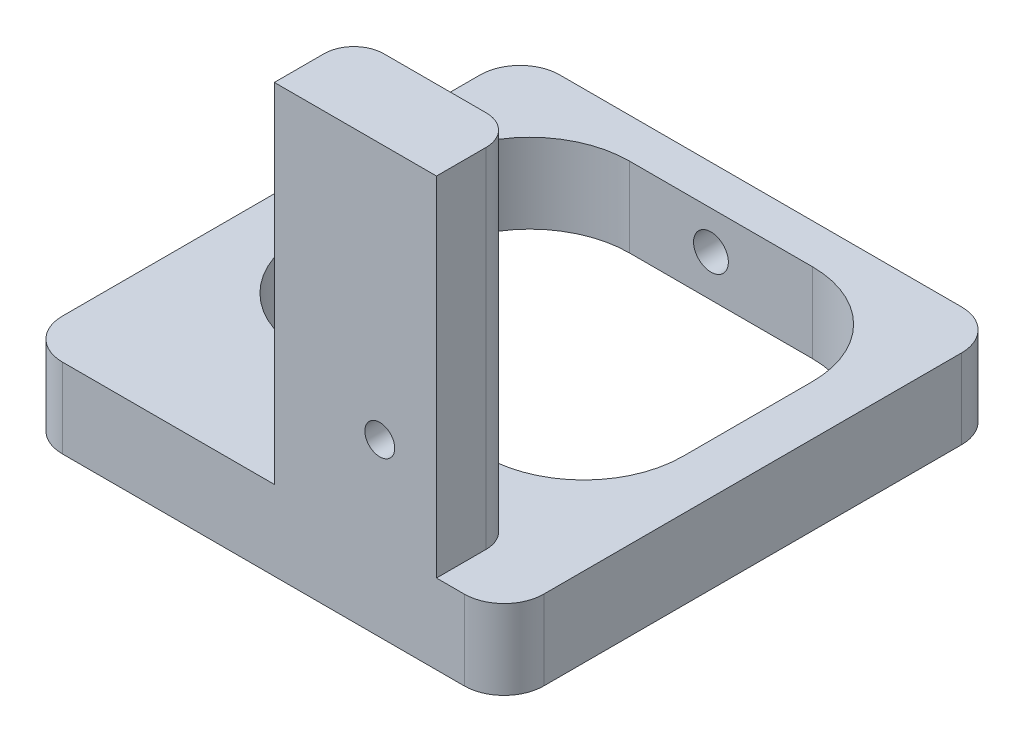
ISO-10303-21;
HEADER;
FILE_DESCRIPTION(('STEP AP214'),'2;1');
FILE_NAME('part.step','',(''),(''),'','','');
FILE_SCHEMA(('AUTOMOTIVE_DESIGN { 1 0 10303 214 1 1 1 1 }'));
ENDSEC;
DATA;
#1=APPLICATION_CONTEXT('core data for automotive mechanical design processes');
#2=APPLICATION_PROTOCOL_DEFINITION('international standard','automotive_design',2000,#1);
#3=PRODUCT_CONTEXT('',#1,'mechanical');
#4=PRODUCT('Part','Part','',(#3));
#5=PRODUCT_RELATED_PRODUCT_CATEGORY('part','',(#4));
#6=PRODUCT_DEFINITION_FORMATION('','',#4);
#7=PRODUCT_DEFINITION_CONTEXT('part definition',#1,'design');
#8=PRODUCT_DEFINITION('design','',#6,#7);
#9=PRODUCT_DEFINITION_SHAPE('','',#8);
#10=(LENGTH_UNIT() NAMED_UNIT(*) SI_UNIT(.MILLI.,.METRE.));
#11=(NAMED_UNIT(*) PLANE_ANGLE_UNIT() SI_UNIT($,.RADIAN.));
#12=(NAMED_UNIT(*) SI_UNIT($,.STERADIAN.) SOLID_ANGLE_UNIT());
#13=UNCERTAINTY_MEASURE_WITH_UNIT(LENGTH_MEASURE(1.E-05),#10,'distance_accuracy_value','');
#14=(GEOMETRIC_REPRESENTATION_CONTEXT(3) GLOBAL_UNCERTAINTY_ASSIGNED_CONTEXT((#13)) GLOBAL_UNIT_ASSIGNED_CONTEXT((#10,
#11,#12)) REPRESENTATION_CONTEXT('',''));
#15=CARTESIAN_POINT('',(0.,0.,0.));
#16=DIRECTION('',(0.,0.,1.));
#17=DIRECTION('',(1.,0.,0.));
#18=AXIS2_PLACEMENT_3D('',#15,#16,#17);
#19=CARTESIAN_POINT('',(325.190686012613,343.382010011375,8.));
#20=DIRECTION('',(0.,0.,-1.));
#21=DIRECTION('',(-1.,0.,0.));
#22=AXIS2_PLACEMENT_3D('',#19,#20,#21);
#23=CYLINDRICAL_SURFACE('',#22,1.50000000000002);
#24=CARTESIAN_POINT('',(325.190686012613,343.382010011375,8.));
#25=DIRECTION('',(0.,0.,1.));
#26=DIRECTION('',(1.,0.,0.));
#27=AXIS2_PLACEMENT_3D('',#24,#25,#26);
#28=CIRCLE('',#27,1.50000000000002);
#29=CARTESIAN_POINT('',(326.690686012613,343.382010011375,8.));
#30=VERTEX_POINT('',#29);
#31=EDGE_CURVE('E281',#30,#30,#28,.T.);
#32=ORIENTED_EDGE('',*,*,#31,.T.);
#33=EDGE_LOOP('',(#32));
#34=FACE_BOUND('',#33,.T.);
#35=CARTESIAN_POINT('',(325.190686012613,343.382010011375,3.2));
#36=DIRECTION('',(0.,0.,-1.));
#37=DIRECTION('',(-1.,0.,0.));
#38=AXIS2_PLACEMENT_3D('',#35,#36,#37);
#39=CIRCLE('',#38,1.50000000000002);
#40=CARTESIAN_POINT('',(323.690686012613,343.382010011375,3.2));
#41=VERTEX_POINT('',#40);
#42=EDGE_CURVE('E317',#41,#41,#39,.T.);
#43=ORIENTED_EDGE('',*,*,#42,.T.);
#44=EDGE_LOOP('',(#43));
#45=FACE_BOUND('',#44,.T.);
#46=ADVANCED_FACE('F37',(#34,#45),#23,.F.);
#47=CARTESIAN_POINT('',(0.,0.,8.));
#48=DIRECTION('',(0.,0.,1.));
#49=DIRECTION('',(1.,0.,0.));
#50=AXIS2_PLACEMENT_3D('',#47,#48,#49);
#51=PLANE('',#50);
#52=DIRECTION('',(-1.,0.,0.));
#53=VECTOR('',#52,1.);
#54=CARTESIAN_POINT('',(289.281750966355,326.182010011375,8.));
#55=LINE('',#54,#53);
#56=CARTESIAN_POINT('',(333.681750966355,326.182010011375,8.00000000000001));
#57=VERTEX_POINT('',#56);
#58=CARTESIAN_POINT('',(293.281750966355,326.182010011375,8.));
#59=VERTEX_POINT('',#58);
#60=EDGE_CURVE('E271',#57,#59,#55,.T.);
#61=ORIENTED_EDGE('',*,*,#60,.F.);
#62=DIRECTION('',(0.,1.,0.));
#63=VECTOR('',#62,1.);
#64=CARTESIAN_POINT('',(333.681750966355,334.182010011375,8.));
#65=LINE('',#64,#63);
#66=CARTESIAN_POINT('',(333.681750966355,334.182010011375,8.00000000000001));
#67=VERTEX_POINT('',#66);
#68=EDGE_CURVE('E354',#57,#67,#65,.T.);
#69=ORIENTED_EDGE('',*,*,#68,.T.);
#70=DIRECTION('',(-1.,0.,0.));
#71=VECTOR('',#70,1.);
#72=CARTESIAN_POINT('',(289.281750966355,334.182010011375,8.));
#73=LINE('',#72,#71);
#74=CARTESIAN_POINT('',(330.890686012613,334.182010011375,8.));
#75=VERTEX_POINT('',#74);
#76=EDGE_CURVE('E285',#67,#75,#73,.T.);
#77=ORIENTED_EDGE('',*,*,#76,.T.);
#78=DIRECTION('',(0.,1.,0.));
#79=VECTOR('',#78,1.);
#80=CARTESIAN_POINT('',(330.890686012613,369.182010011375,8.));
#81=LINE('',#80,#79);
#82=CARTESIAN_POINT('',(330.890686012613,369.182010011375,8.));
#83=VERTEX_POINT('',#82);
#84=EDGE_CURVE('E297',#75,#83,#81,.T.);
#85=ORIENTED_EDGE('',*,*,#84,.T.);
#86=DIRECTION('',(-1.,0.,0.));
#87=VECTOR('',#86,1.);
#88=CARTESIAN_POINT('',(314.590686012613,369.182010011375,8.));
#89=LINE('',#88,#87);
#90=CARTESIAN_POINT('',(314.590686012613,369.182010011375,8.));
#91=VERTEX_POINT('',#90);
#92=EDGE_CURVE('E300',#83,#91,#89,.T.);
#93=ORIENTED_EDGE('',*,*,#92,.T.);
#94=DIRECTION('',(0.,-1.,0.));
#95=VECTOR('',#94,1.);
#96=CARTESIAN_POINT('',(314.590686012613,369.182010011375,8.));
#97=LINE('',#96,#95);
#98=CARTESIAN_POINT('',(314.590686012613,334.182010011375,8.));
#99=VERTEX_POINT('',#98);
#100=EDGE_CURVE('E295',#91,#99,#97,.T.);
#101=ORIENTED_EDGE('',*,*,#100,.T.);
#102=CARTESIAN_POINT('',(293.281750966355,334.182010011375,8.));
#103=VERTEX_POINT('',#102);
#104=EDGE_CURVE('E284',#99,#103,#73,.T.);
#105=ORIENTED_EDGE('',*,*,#104,.T.);
#106=DIRECTION('',(0.,1.,0.));
#107=VECTOR('',#106,1.);
#108=CARTESIAN_POINT('',(293.281750966355,326.182010011375,8.));
#109=LINE('',#108,#107);
#110=EDGE_CURVE('E352',#103,#59,#109,.F.);
#111=ORIENTED_EDGE('',*,*,#110,.T.);
#112=EDGE_LOOP('',(#61,#69,#77,#85,#93,#101,#105,#111));
#113=FACE_BOUND('',#112,.T.);
#114=ORIENTED_EDGE('',*,*,#31,.F.);
#115=EDGE_LOOP('',(#114));
#116=FACE_BOUND('',#115,.T.);
#117=ADVANCED_FACE('F443',(#113,#116),#51,.T.);
#118=CARTESIAN_POINT('',(0.,0.,0.));
#119=DIRECTION('',(0.,0.,1.));
#120=DIRECTION('',(1.,0.,0.));
#121=AXIS2_PLACEMENT_3D('',#118,#119,#120);
#122=PLANE('',#121);
#123=DIRECTION('',(1.,0.,0.));
#124=VECTOR('',#123,1.);
#125=CARTESIAN_POINT('',(314.590686012613,334.182010011375,0.));
#126=LINE('',#125,#124);
#127=CARTESIAN_POINT('',(317.590686012613,334.182010011375,0.));
#128=VERTEX_POINT('',#127);
#129=CARTESIAN_POINT('',(327.890686012613,334.182010011375,0.));
#130=VERTEX_POINT('',#129);
#131=EDGE_CURVE('E294',#128,#130,#126,.T.);
#132=ORIENTED_EDGE('',*,*,#131,.F.);
#133=DIRECTION('',(0.,-1.,0.));
#134=VECTOR('',#133,1.);
#135=CARTESIAN_POINT('',(317.590686012613,0.,0.));
#136=LINE('',#135,#134);
#137=CARTESIAN_POINT('',(317.590686012613,369.182010011375,0.));
#138=VERTEX_POINT('',#137);
#139=EDGE_CURVE('E364',#128,#138,#136,.F.);
#140=ORIENTED_EDGE('',*,*,#139,.T.);
#141=DIRECTION('',(-1.,0.,0.));
#142=VECTOR('',#141,1.);
#143=CARTESIAN_POINT('',(314.590686012613,369.182010011375,0.));
#144=LINE('',#143,#142);
#145=CARTESIAN_POINT('',(327.890686012613,369.182010011375,0.));
#146=VERTEX_POINT('',#145);
#147=EDGE_CURVE('E298',#146,#138,#144,.T.);
#148=ORIENTED_EDGE('',*,*,#147,.F.);
#149=DIRECTION('',(0.,1.,0.));
#150=VECTOR('',#149,1.);
#151=CARTESIAN_POINT('',(327.890686012613,0.,0.));
#152=LINE('',#151,#150);
#153=CARTESIAN_POINT('',(327.890686012613,344.689679694437,0.));
#154=VERTEX_POINT('',#153);
#155=EDGE_CURVE('E362',#146,#154,#152,.F.);
#156=ORIENTED_EDGE('',*,*,#155,.T.);
#157=CARTESIAN_POINT('',(325.190686012613,343.382010011375,0.));
#158=DIRECTION('',(0.,0.,-1.));
#159=DIRECTION('',(-1.,0.,0.));
#160=AXIS2_PLACEMENT_3D('',#157,#158,#159);
#161=CIRCLE('',#160,2.99999999999999);
#162=CARTESIAN_POINT('',(327.890686012613,342.074340328312,0.));
#163=VERTEX_POINT('',#162);
#164=EDGE_CURVE('E504',#163,#154,#161,.T.);
#165=ORIENTED_EDGE('',*,*,#164,.F.);
#166=DIRECTION('',(0.,1.,0.));
#167=VECTOR('',#166,1.);
#168=CARTESIAN_POINT('',(327.890686012613,0.,0.));
#169=LINE('',#168,#167);
#170=EDGE_CURVE('E360',#163,#130,#169,.F.);
#171=ORIENTED_EDGE('',*,*,#170,.T.);
#172=EDGE_LOOP('',(#132,#140,#148,#156,#165,#171));
#173=FACE_BOUND('',#172,.T.);
#174=ADVANCED_FACE('F447',(#173),#122,.F.);
#175=CARTESIAN_POINT('',(314.590686012613,369.182010011375,8.));
#176=DIRECTION('',(1.,0.,0.));
#177=DIRECTION('',(0.,0.,-1.));
#178=AXIS2_PLACEMENT_3D('',#175,#176,#177);
#179=PLANE('',#178);
#180=DIRECTION('',(0.,0.,-1.));
#181=VECTOR('',#180,1.);
#182=CARTESIAN_POINT('',(314.590686012613,369.182010011375,8.));
#183=LINE('',#182,#181);
#184=CARTESIAN_POINT('',(314.590686012613,369.182010011375,3.));
#185=VERTEX_POINT('',#184);
#186=EDGE_CURVE('E302',#91,#185,#183,.T.);
#187=ORIENTED_EDGE('',*,*,#186,.T.);
#188=DIRECTION('',(0.,-1.,0.));
#189=VECTOR('',#188,1.);
#190=CARTESIAN_POINT('',(314.590686012613,369.182010011375,3.));
#191=LINE('',#190,#189);
#192=CARTESIAN_POINT('',(314.590686012613,334.182010011375,3.));
#193=VERTEX_POINT('',#192);
#194=EDGE_CURVE('E357',#185,#193,#191,.T.);
#195=ORIENTED_EDGE('',*,*,#194,.T.);
#196=DIRECTION('',(0.,0.,-1.));
#197=VECTOR('',#196,1.);
#198=CARTESIAN_POINT('',(314.590686012613,334.182010011375,8.));
#199=LINE('',#198,#197);
#200=EDGE_CURVE('E313',#99,#193,#199,.T.);
#201=ORIENTED_EDGE('',*,*,#200,.F.);
#202=ORIENTED_EDGE('',*,*,#100,.F.);
#203=EDGE_LOOP('',(#187,#195,#201,#202));
#204=FACE_BOUND('',#203,.T.);
#205=ADVANCED_FACE('F451',(#204),#179,.F.);
#206=CARTESIAN_POINT('',(330.890686012613,369.182010011375,8.));
#207=DIRECTION('',(-1.,0.,0.));
#208=DIRECTION('',(0.,0.,1.));
#209=AXIS2_PLACEMENT_3D('',#206,#207,#208);
#210=PLANE('',#209);
#211=DIRECTION('',(0.,0.,-1.));
#212=VECTOR('',#211,1.);
#213=CARTESIAN_POINT('',(330.890686012613,334.182010011375,8.));
#214=LINE('',#213,#212);
#215=CARTESIAN_POINT('',(330.890686012613,334.182010011375,3.));
#216=VERTEX_POINT('',#215);
#217=EDGE_CURVE('E311',#75,#216,#214,.T.);
#218=ORIENTED_EDGE('',*,*,#217,.T.);
#219=DIRECTION('',(0.,1.,0.));
#220=VECTOR('',#219,1.);
#221=CARTESIAN_POINT('',(330.890686012613,369.182010011375,3.));
#222=LINE('',#221,#220);
#223=CARTESIAN_POINT('',(330.890686012613,369.182010011375,3.));
#224=VERTEX_POINT('',#223);
#225=EDGE_CURVE('E369',#216,#224,#222,.T.);
#226=ORIENTED_EDGE('',*,*,#225,.T.);
#227=DIRECTION('',(0.,0.,-1.));
#228=VECTOR('',#227,1.);
#229=CARTESIAN_POINT('',(330.890686012613,369.182010011375,8.));
#230=LINE('',#229,#228);
#231=EDGE_CURVE('E308',#83,#224,#230,.T.);
#232=ORIENTED_EDGE('',*,*,#231,.F.);
#233=ORIENTED_EDGE('',*,*,#84,.F.);
#234=EDGE_LOOP('',(#218,#226,#232,#233));
#235=FACE_BOUND('',#234,.T.);
#236=ADVANCED_FACE('F455',(#235),#210,.F.);
#237=CARTESIAN_POINT('',(314.590686012613,369.182010011375,8.));
#238=DIRECTION('',(0.,-1.,0.));
#239=DIRECTION('',(0.,0.,-1.));
#240=AXIS2_PLACEMENT_3D('',#237,#238,#239);
#241=PLANE('',#240);
#242=ORIENTED_EDGE('',*,*,#147,.T.);
#243=CARTESIAN_POINT('',(317.590686012613,369.182010011375,3.));
#244=DIRECTION('',(0.,-1.,0.));
#245=DIRECTION('',(0.,0.,-1.));
#246=AXIS2_PLACEMENT_3D('',#243,#244,#245);
#247=CIRCLE('',#246,3.);
#248=EDGE_CURVE('E367',#138,#185,#247,.F.);
#249=ORIENTED_EDGE('',*,*,#248,.T.);
#250=ORIENTED_EDGE('',*,*,#186,.F.);
#251=ORIENTED_EDGE('',*,*,#92,.F.);
#252=ORIENTED_EDGE('',*,*,#231,.T.);
#253=CARTESIAN_POINT('',(327.890686012613,369.182010011375,3.));
#254=DIRECTION('',(0.,-1.,0.));
#255=DIRECTION('',(0.,0.,-1.));
#256=AXIS2_PLACEMENT_3D('',#253,#254,#255);
#257=CIRCLE('',#256,3.);
#258=EDGE_CURVE('E59',#224,#146,#257,.F.);
#259=ORIENTED_EDGE('',*,*,#258,.T.);
#260=EDGE_LOOP('',(#242,#249,#250,#251,#252,#259));
#261=FACE_BOUND('',#260,.T.);
#262=ADVANCED_FACE('F429',(#261),#241,.F.);
#263=CARTESIAN_POINT('',(0.,334.182010011375,0.));
#264=DIRECTION('',(0.,1.,0.));
#265=DIRECTION('',(0.,0.,1.));
#266=AXIS2_PLACEMENT_3D('',#263,#264,#265);
#267=PLANE('',#266);
#268=DIRECTION('',(0.,0.,-1.));
#269=VECTOR('',#268,1.);
#270=CARTESIAN_POINT('',(294.281750966355,334.182010011375,-28.));
#271=LINE('',#270,#269);
#272=CARTESIAN_POINT('',(294.281750966355,334.182010011375,-15.));
#273=VERTEX_POINT('',#272);
#274=CARTESIAN_POINT('',(294.281750966355,334.182010011375,-28.));
#275=VERTEX_POINT('',#274);
#276=EDGE_CURVE('E206',#273,#275,#271,.T.);
#277=ORIENTED_EDGE('',*,*,#276,.T.);
#278=CARTESIAN_POINT('',(304.281750966355,334.182010011375,-28.));
#279=DIRECTION('',(0.,-1.,0.));
#280=DIRECTION('',(0.,0.,1.));
#281=AXIS2_PLACEMENT_3D('',#278,#279,#280);
#282=CIRCLE('',#281,10.);
#283=CARTESIAN_POINT('',(304.281750966355,334.182010011375,-38.));
#284=VERTEX_POINT('',#283);
#285=EDGE_CURVE('E235',#275,#284,#282,.T.);
#286=ORIENTED_EDGE('',*,*,#285,.T.);
#287=DIRECTION('',(1.,0.,0.));
#288=VECTOR('',#287,1.);
#289=CARTESIAN_POINT('',(322.681750966355,334.182010011375,-38.));
#290=LINE('',#289,#288);
#291=CARTESIAN_POINT('',(322.681750966355,334.182010011375,-38.));
#292=VERTEX_POINT('',#291);
#293=EDGE_CURVE('E212',#284,#292,#290,.T.);
#294=ORIENTED_EDGE('',*,*,#293,.T.);
#295=CARTESIAN_POINT('',(322.681750966355,334.182010011375,-28.));
#296=DIRECTION('',(0.,-1.,0.));
#297=DIRECTION('',(0.,0.,1.));
#298=AXIS2_PLACEMENT_3D('',#295,#296,#297);
#299=CIRCLE('',#298,10.);
#300=CARTESIAN_POINT('',(332.681750966355,334.182010011375,-28.));
#301=VERTEX_POINT('',#300);
#302=EDGE_CURVE('E239',#292,#301,#299,.T.);
#303=ORIENTED_EDGE('',*,*,#302,.T.);
#304=DIRECTION('',(0.,0.,1.));
#305=VECTOR('',#304,1.);
#306=CARTESIAN_POINT('',(332.681750966355,334.182010011375,-28.));
#307=LINE('',#306,#305);
#308=CARTESIAN_POINT('',(332.681750966355,334.182010011375,-15.));
#309=VERTEX_POINT('',#308);
#310=EDGE_CURVE('E242',#301,#309,#307,.T.);
#311=ORIENTED_EDGE('',*,*,#310,.T.);
#312=CARTESIAN_POINT('',(322.681750966355,334.182010011375,-15.));
#313=DIRECTION('',(0.,-1.,0.));
#314=DIRECTION('',(0.,0.,-1.));
#315=AXIS2_PLACEMENT_3D('',#312,#313,#314);
#316=CIRCLE('',#315,10.);
#317=CARTESIAN_POINT('',(322.681750966355,334.182010011375,-4.99999999999999));
#318=VERTEX_POINT('',#317);
#319=EDGE_CURVE('E245',#309,#318,#316,.T.);
#320=ORIENTED_EDGE('',*,*,#319,.T.);
#321=DIRECTION('',(-1.,0.,0.));
#322=VECTOR('',#321,1.);
#323=CARTESIAN_POINT('',(322.681750966355,334.182010011375,-5.));
#324=LINE('',#323,#322);
#325=CARTESIAN_POINT('',(304.281750966355,334.182010011375,-5.));
#326=VERTEX_POINT('',#325);
#327=EDGE_CURVE('E248',#318,#326,#324,.T.);
#328=ORIENTED_EDGE('',*,*,#327,.T.);
#329=CARTESIAN_POINT('',(304.281750966355,334.182010011375,-15.));
#330=DIRECTION('',(0.,-1.,0.));
#331=DIRECTION('',(0.,0.,1.));
#332=AXIS2_PLACEMENT_3D('',#329,#330,#331);
#333=CIRCLE('',#332,10.);
#334=EDGE_CURVE('E251',#326,#273,#333,.T.);
#335=ORIENTED_EDGE('',*,*,#334,.T.);
#336=EDGE_LOOP('',(#277,#286,#294,#303,#311,#320,#328,#335));
#337=FACE_BOUND('',#336,.T.);
#338=DIRECTION('',(0.,0.,1.));
#339=VECTOR('',#338,1.);
#340=CARTESIAN_POINT('',(337.681750966355,334.182010011375,-42.));
#341=LINE('',#340,#339);
#342=CARTESIAN_POINT('',(337.681750966355,334.182010011375,-38.));
#343=VERTEX_POINT('',#342);
#344=CARTESIAN_POINT('',(337.681750966355,334.182010011375,4.));
#345=VERTEX_POINT('',#344);
#346=EDGE_CURVE('E213',#343,#345,#341,.T.);
#347=ORIENTED_EDGE('',*,*,#346,.F.);
#348=CARTESIAN_POINT('',(333.681750966355,334.182010011375,-38.));
#349=DIRECTION('',(0.,1.,0.));
#350=DIRECTION('',(0.,0.,1.));
#351=AXIS2_PLACEMENT_3D('',#348,#349,#350);
#352=CIRCLE('',#351,4.);
#353=CARTESIAN_POINT('',(333.681750966355,334.182010011375,-42.));
#354=VERTEX_POINT('',#353);
#355=EDGE_CURVE('E332',#343,#354,#352,.T.);
#356=ORIENTED_EDGE('',*,*,#355,.T.);
#357=DIRECTION('',(1.,0.,0.));
#358=VECTOR('',#357,1.);
#359=CARTESIAN_POINT('',(289.281750966355,334.182010011375,-42.));
#360=LINE('',#359,#358);
#361=CARTESIAN_POINT('',(293.281750966355,334.182010011375,-42.));
#362=VERTEX_POINT('',#361);
#363=EDGE_CURVE('E272',#362,#354,#360,.T.);
#364=ORIENTED_EDGE('',*,*,#363,.F.);
#365=CARTESIAN_POINT('',(293.281750966355,334.182010011375,-38.));
#366=DIRECTION('',(0.,1.,0.));
#367=DIRECTION('',(0.,0.,1.));
#368=AXIS2_PLACEMENT_3D('',#365,#366,#367);
#369=CIRCLE('',#368,4.);
#370=CARTESIAN_POINT('',(289.281750966355,334.182010011375,-38.));
#371=VERTEX_POINT('',#370);
#372=EDGE_CURVE('E330',#362,#371,#369,.T.);
#373=ORIENTED_EDGE('',*,*,#372,.T.);
#374=DIRECTION('',(0.,0.,-1.));
#375=VECTOR('',#374,1.);
#376=CARTESIAN_POINT('',(289.281750966355,334.182010011375,-42.));
#377=LINE('',#376,#375);
#378=CARTESIAN_POINT('',(289.281750966355,334.182010011375,4.));
#379=VERTEX_POINT('',#378);
#380=EDGE_CURVE('E287',#379,#371,#377,.T.);
#381=ORIENTED_EDGE('',*,*,#380,.F.);
#382=CARTESIAN_POINT('',(293.281750966355,334.182010011375,4.));
#383=DIRECTION('',(0.,1.,0.));
#384=DIRECTION('',(0.,0.,1.));
#385=AXIS2_PLACEMENT_3D('',#382,#383,#384);
#386=CIRCLE('',#385,4.);
#387=EDGE_CURVE('E326',#379,#103,#386,.T.);
#388=ORIENTED_EDGE('',*,*,#387,.T.);
#389=ORIENTED_EDGE('',*,*,#104,.F.);
#390=ORIENTED_EDGE('',*,*,#200,.T.);
#391=CARTESIAN_POINT('',(317.590686012613,334.182010011375,3.));
#392=DIRECTION('',(0.,1.,0.));
#393=DIRECTION('',(0.,0.,1.));
#394=AXIS2_PLACEMENT_3D('',#391,#392,#393);
#395=CIRCLE('',#394,3.);
#396=EDGE_CURVE('E46',#193,#128,#395,.F.);
#397=ORIENTED_EDGE('',*,*,#396,.T.);
#398=ORIENTED_EDGE('',*,*,#131,.T.);
#399=CARTESIAN_POINT('',(327.890686012613,334.182010011375,3.));
#400=DIRECTION('',(0.,1.,0.));
#401=DIRECTION('',(0.,0.,1.));
#402=AXIS2_PLACEMENT_3D('',#399,#400,#401);
#403=CIRCLE('',#402,3.);
#404=EDGE_CURVE('E11',#130,#216,#403,.F.);
#405=ORIENTED_EDGE('',*,*,#404,.T.);
#406=ORIENTED_EDGE('',*,*,#217,.F.);
#407=ORIENTED_EDGE('',*,*,#76,.F.);
#408=CARTESIAN_POINT('',(333.681750966355,334.182010011375,4.));
#409=DIRECTION('',(0.,1.,0.));
#410=DIRECTION('',(0.,0.,1.));
#411=AXIS2_PLACEMENT_3D('',#408,#409,#410);
#412=CIRCLE('',#411,4.);
#413=EDGE_CURVE('E328',#67,#345,#412,.T.);
#414=ORIENTED_EDGE('',*,*,#413,.T.);
#415=EDGE_LOOP('',(#347,#356,#364,#373,#381,#388,#389,#390,#397,#398,#405,#406,#407,#414));
#416=FACE_BOUND('',#415,.T.);
#417=ADVANCED_FACE('F425',(#337,#416),#267,.T.);
#418=CARTESIAN_POINT('',(0.,326.182010011375,0.));
#419=DIRECTION('',(0.,1.,0.));
#420=DIRECTION('',(0.,0.,1.));
#421=AXIS2_PLACEMENT_3D('',#418,#419,#420);
#422=PLANE('',#421);
#423=DIRECTION('',(1.,0.,0.));
#424=VECTOR('',#423,1.);
#425=CARTESIAN_POINT('',(289.281750966355,326.182010011375,-42.));
#426=LINE('',#425,#424);
#427=CARTESIAN_POINT('',(293.281750966355,326.182010011375,-42.));
#428=VERTEX_POINT('',#427);
#429=CARTESIAN_POINT('',(333.681750966355,326.182010011375,-42.));
#430=VERTEX_POINT('',#429);
#431=EDGE_CURVE('E278',#428,#430,#426,.T.);
#432=ORIENTED_EDGE('',*,*,#431,.T.);
#433=CARTESIAN_POINT('',(333.681750966355,326.182010011375,-38.));
#434=DIRECTION('',(0.,1.,0.));
#435=DIRECTION('',(0.,0.,1.));
#436=AXIS2_PLACEMENT_3D('',#433,#434,#435);
#437=CIRCLE('',#436,4.);
#438=CARTESIAN_POINT('',(337.681750966355,326.182010011375,-38.));
#439=VERTEX_POINT('',#438);
#440=EDGE_CURVE('E345',#430,#439,#437,.F.);
#441=ORIENTED_EDGE('',*,*,#440,.T.);
#442=DIRECTION('',(0.,0.,1.));
#443=VECTOR('',#442,1.);
#444=CARTESIAN_POINT('',(337.681750966355,326.182010011375,-42.));
#445=LINE('',#444,#443);
#446=CARTESIAN_POINT('',(337.681750966355,326.182010011375,4.));
#447=VERTEX_POINT('',#446);
#448=EDGE_CURVE('E268',#439,#447,#445,.T.);
#449=ORIENTED_EDGE('',*,*,#448,.T.);
#450=CARTESIAN_POINT('',(333.681750966355,326.182010011375,4.));
#451=DIRECTION('',(0.,1.,0.));
#452=DIRECTION('',(0.,0.,1.));
#453=AXIS2_PLACEMENT_3D('',#450,#451,#452);
#454=CIRCLE('',#453,4.);
#455=EDGE_CURVE('E341',#447,#57,#454,.F.);
#456=ORIENTED_EDGE('',*,*,#455,.T.);
#457=ORIENTED_EDGE('',*,*,#60,.T.);
#458=CARTESIAN_POINT('',(293.281750966355,326.182010011375,4.));
#459=DIRECTION('',(0.,1.,0.));
#460=DIRECTION('',(0.,0.,1.));
#461=AXIS2_PLACEMENT_3D('',#458,#459,#460);
#462=CIRCLE('',#461,4.);
#463=CARTESIAN_POINT('',(289.281750966355,326.182010011375,4.));
#464=VERTEX_POINT('',#463);
#465=EDGE_CURVE('E339',#59,#464,#462,.F.);
#466=ORIENTED_EDGE('',*,*,#465,.T.);
#467=DIRECTION('',(0.,0.,-1.));
#468=VECTOR('',#467,1.);
#469=CARTESIAN_POINT('',(289.281750966355,326.182010011375,-42.));
#470=LINE('',#469,#468);
#471=CARTESIAN_POINT('',(289.281750966355,326.182010011375,-38.));
#472=VERTEX_POINT('',#471);
#473=EDGE_CURVE('E275',#464,#472,#470,.T.);
#474=ORIENTED_EDGE('',*,*,#473,.T.);
#475=CARTESIAN_POINT('',(293.281750966355,326.182010011375,-38.));
#476=DIRECTION('',(0.,1.,0.));
#477=DIRECTION('',(0.,0.,1.));
#478=AXIS2_PLACEMENT_3D('',#475,#476,#477);
#479=CIRCLE('',#478,4.);
#480=EDGE_CURVE('E343',#472,#428,#479,.F.);
#481=ORIENTED_EDGE('',*,*,#480,.T.);
#482=EDGE_LOOP('',(#432,#441,#449,#456,#457,#466,#474,#481));
#483=FACE_BOUND('',#482,.T.);
#484=CARTESIAN_POINT('',(304.281750966355,326.182010011375,-28.));
#485=DIRECTION('',(0.,-1.,0.));
#486=DIRECTION('',(0.,0.,1.));
#487=AXIS2_PLACEMENT_3D('',#484,#485,#486);
#488=CIRCLE('',#487,10.);
#489=CARTESIAN_POINT('',(294.281750966355,326.182010011375,-28.));
#490=VERTEX_POINT('',#489);
#491=CARTESIAN_POINT('',(304.281750966355,326.182010011375,-38.));
#492=VERTEX_POINT('',#491);
#493=EDGE_CURVE('E195',#490,#492,#488,.T.);
#494=ORIENTED_EDGE('',*,*,#493,.F.);
#495=DIRECTION('',(0.,0.,-1.));
#496=VECTOR('',#495,1.);
#497=CARTESIAN_POINT('',(294.281750966355,326.182010011375,-28.));
#498=LINE('',#497,#496);
#499=CARTESIAN_POINT('',(294.281750966355,326.182010011375,-15.));
#500=VERTEX_POINT('',#499);
#501=EDGE_CURVE('E233',#500,#490,#498,.T.);
#502=ORIENTED_EDGE('',*,*,#501,.F.);
#503=CARTESIAN_POINT('',(304.281750966355,326.182010011375,-15.));
#504=DIRECTION('',(0.,-1.,0.));
#505=DIRECTION('',(0.,0.,1.));
#506=AXIS2_PLACEMENT_3D('',#503,#504,#505);
#507=CIRCLE('',#506,10.);
#508=CARTESIAN_POINT('',(304.281750966355,326.182010011375,-5.));
#509=VERTEX_POINT('',#508);
#510=EDGE_CURVE('E230',#509,#500,#507,.T.);
#511=ORIENTED_EDGE('',*,*,#510,.F.);
#512=DIRECTION('',(-1.,0.,0.));
#513=VECTOR('',#512,1.);
#514=CARTESIAN_POINT('',(322.681750966355,326.182010011375,-5.));
#515=LINE('',#514,#513);
#516=CARTESIAN_POINT('',(322.681750966355,326.182010011375,-4.99999999999999));
#517=VERTEX_POINT('',#516);
#518=EDGE_CURVE('E228',#517,#509,#515,.T.);
#519=ORIENTED_EDGE('',*,*,#518,.F.);
#520=CARTESIAN_POINT('',(322.681750966355,326.182010011375,-15.));
#521=DIRECTION('',(0.,-1.,0.));
#522=DIRECTION('',(0.,0.,-1.));
#523=AXIS2_PLACEMENT_3D('',#520,#521,#522);
#524=CIRCLE('',#523,10.);
#525=CARTESIAN_POINT('',(332.681750966355,326.182010011375,-15.));
#526=VERTEX_POINT('',#525);
#527=EDGE_CURVE('E226',#526,#517,#524,.T.);
#528=ORIENTED_EDGE('',*,*,#527,.F.);
#529=DIRECTION('',(0.,0.,1.));
#530=VECTOR('',#529,1.);
#531=CARTESIAN_POINT('',(332.681750966355,326.182010011375,-28.));
#532=LINE('',#531,#530);
#533=CARTESIAN_POINT('',(332.681750966355,326.182010011375,-28.));
#534=VERTEX_POINT('',#533);
#535=EDGE_CURVE('E221',#534,#526,#532,.T.);
#536=ORIENTED_EDGE('',*,*,#535,.F.);
#537=CARTESIAN_POINT('',(322.681750966355,326.182010011375,-28.));
#538=DIRECTION('',(0.,-1.,0.));
#539=DIRECTION('',(0.,0.,1.));
#540=AXIS2_PLACEMENT_3D('',#537,#538,#539);
#541=CIRCLE('',#540,10.);
#542=CARTESIAN_POINT('',(322.681750966355,326.182010011375,-38.));
#543=VERTEX_POINT('',#542);
#544=EDGE_CURVE('E219',#543,#534,#541,.T.);
#545=ORIENTED_EDGE('',*,*,#544,.F.);
#546=DIRECTION('',(1.,0.,0.));
#547=VECTOR('',#546,1.);
#548=CARTESIAN_POINT('',(322.681750966355,326.182010011375,-38.));
#549=LINE('',#548,#547);
#550=EDGE_CURVE('E205',#492,#543,#549,.T.);
#551=ORIENTED_EDGE('',*,*,#550,.F.);
#552=EDGE_LOOP('',(#494,#502,#511,#519,#528,#536,#545,#551));
#553=FACE_BOUND('',#552,.T.);
#554=ADVANCED_FACE('F217',(#483,#553),#422,.F.);
#555=CARTESIAN_POINT('',(337.681750966355,326.182010011375,-42.));
#556=DIRECTION('',(-1.,0.,0.));
#557=DIRECTION('',(0.,0.,1.));
#558=AXIS2_PLACEMENT_3D('',#555,#556,#557);
#559=PLANE('',#558);
#560=ORIENTED_EDGE('',*,*,#448,.F.);
#561=DIRECTION('',(0.,1.,0.));
#562=VECTOR('',#561,1.);
#563=CARTESIAN_POINT('',(337.681750966355,326.182010011375,-38.));
#564=LINE('',#563,#562);
#565=EDGE_CURVE('E323',#439,#343,#564,.T.);
#566=ORIENTED_EDGE('',*,*,#565,.T.);
#567=ORIENTED_EDGE('',*,*,#346,.T.);
#568=DIRECTION('',(0.,1.,0.));
#569=VECTOR('',#568,1.);
#570=CARTESIAN_POINT('',(337.681750966355,326.182010011375,4.));
#571=LINE('',#570,#569);
#572=EDGE_CURVE('E316',#345,#447,#571,.F.);
#573=ORIENTED_EDGE('',*,*,#572,.T.);
#574=EDGE_LOOP('',(#560,#566,#567,#573));
#575=FACE_BOUND('',#574,.T.);
#576=ADVANCED_FACE('F424',(#575),#559,.F.);
#577=CARTESIAN_POINT('',(289.281750966355,326.182010011375,-42.));
#578=DIRECTION('',(1.,0.,0.));
#579=DIRECTION('',(0.,0.,-1.));
#580=AXIS2_PLACEMENT_3D('',#577,#578,#579);
#581=PLANE('',#580);
#582=CARTESIAN_POINT('',(289.281750966355,330.202094394195,-21.));
#583=DIRECTION('',(-1.,0.,0.));
#584=DIRECTION('',(0.,0.,1.));
#585=AXIS2_PLACEMENT_3D('',#582,#583,#584);
#586=CIRCLE('',#585,1.75);
#587=CARTESIAN_POINT('',(289.281750966355,330.202094394195,-19.25));
#588=VERTEX_POINT('',#587);
#589=EDGE_CURVE('E320',#588,#588,#586,.T.);
#590=ORIENTED_EDGE('',*,*,#589,.F.);
#591=EDGE_LOOP('',(#590));
#592=FACE_BOUND('',#591,.T.);
#593=ORIENTED_EDGE('',*,*,#380,.T.);
#594=DIRECTION('',(0.,1.,0.));
#595=VECTOR('',#594,1.);
#596=CARTESIAN_POINT('',(289.281750966355,326.182010011375,-38.));
#597=LINE('',#596,#595);
#598=EDGE_CURVE('E350',#371,#472,#597,.F.);
#599=ORIENTED_EDGE('',*,*,#598,.T.);
#600=ORIENTED_EDGE('',*,*,#473,.F.);
#601=DIRECTION('',(0.,1.,0.));
#602=VECTOR('',#601,1.);
#603=CARTESIAN_POINT('',(289.281750966355,334.182010011375,4.));
#604=LINE('',#603,#602);
#605=EDGE_CURVE('E347',#464,#379,#604,.T.);
#606=ORIENTED_EDGE('',*,*,#605,.T.);
#607=EDGE_LOOP('',(#593,#599,#600,#606));
#608=FACE_BOUND('',#607,.T.);
#609=ADVANCED_FACE('F433',(#592,#608),#581,.F.);
#610=CARTESIAN_POINT('',(289.281750966355,326.182010011375,-42.));
#611=DIRECTION('',(0.,0.,1.));
#612=DIRECTION('',(1.,0.,0.));
#613=AXIS2_PLACEMENT_3D('',#610,#611,#612);
#614=PLANE('',#613);
#615=CARTESIAN_POINT('',(312.481750966355,330.362434357887,-42.));
#616=DIRECTION('',(0.,0.,-1.));
#617=DIRECTION('',(-1.,0.,0.));
#618=AXIS2_PLACEMENT_3D('',#615,#616,#617);
#619=CIRCLE('',#618,1.74999999999998);
#620=CARTESIAN_POINT('',(310.731750966355,330.362434357887,-42.));
#621=VERTEX_POINT('',#620);
#622=EDGE_CURVE('E535',#621,#621,#619,.T.);
#623=ORIENTED_EDGE('',*,*,#622,.F.);
#624=EDGE_LOOP('',(#623));
#625=FACE_BOUND('',#624,.T.);
#626=ORIENTED_EDGE('',*,*,#363,.T.);
#627=DIRECTION('',(0.,1.,0.));
#628=VECTOR('',#627,1.);
#629=CARTESIAN_POINT('',(333.681750966355,326.182010011375,-42.));
#630=LINE('',#629,#628);
#631=EDGE_CURVE('E337',#354,#430,#630,.F.);
#632=ORIENTED_EDGE('',*,*,#631,.T.);
#633=ORIENTED_EDGE('',*,*,#431,.F.);
#634=DIRECTION('',(0.,1.,0.));
#635=VECTOR('',#634,1.);
#636=CARTESIAN_POINT('',(293.281750966355,326.182010011375,-42.));
#637=LINE('',#636,#635);
#638=EDGE_CURVE('E334',#428,#362,#637,.T.);
#639=ORIENTED_EDGE('',*,*,#638,.T.);
#640=EDGE_LOOP('',(#626,#632,#633,#639));
#641=FACE_BOUND('',#640,.T.);
#642=ADVANCED_FACE('F421',(#625,#641),#614,.F.);
#643=CARTESIAN_POINT('',(304.281750966355,326.182010011375,-28.));
#644=DIRECTION('',(0.,1.,0.));
#645=DIRECTION('',(0.,0.,1.));
#646=AXIS2_PLACEMENT_3D('',#643,#644,#645);
#647=CYLINDRICAL_SURFACE('',#646,10.);
#648=ORIENTED_EDGE('',*,*,#285,.F.);
#649=DIRECTION('',(0.,1.,0.));
#650=VECTOR('',#649,1.);
#651=CARTESIAN_POINT('',(294.281750966355,326.182010011375,-28.));
#652=LINE('',#651,#650);
#653=EDGE_CURVE('E201',#490,#275,#652,.T.);
#654=ORIENTED_EDGE('',*,*,#653,.F.);
#655=ORIENTED_EDGE('',*,*,#493,.T.);
#656=DIRECTION('',(0.,1.,0.));
#657=VECTOR('',#656,1.);
#658=CARTESIAN_POINT('',(304.281750966355,326.182010011375,-38.));
#659=LINE('',#658,#657);
#660=EDGE_CURVE('E198',#492,#284,#659,.T.);
#661=ORIENTED_EDGE('',*,*,#660,.T.);
#662=EDGE_LOOP('',(#648,#654,#655,#661));
#663=FACE_BOUND('',#662,.T.);
#664=ADVANCED_FACE('F197',(#663),#647,.F.);
#665=CARTESIAN_POINT('',(322.681750966355,326.182010011375,-38.));
#666=DIRECTION('',(0.,0.,1.));
#667=DIRECTION('',(1.,0.,0.));
#668=AXIS2_PLACEMENT_3D('',#665,#666,#667);
#669=PLANE('',#668);
#670=CARTESIAN_POINT('',(312.481750966355,330.362434357887,-38.));
#671=DIRECTION('',(0.,0.,1.));
#672=DIRECTION('',(1.,0.,0.));
#673=AXIS2_PLACEMENT_3D('',#670,#671,#672);
#674=CIRCLE('',#673,1.74999999999998);
#675=CARTESIAN_POINT('',(314.231750966355,330.362434357887,-38.));
#676=VERTEX_POINT('',#675);
#677=EDGE_CURVE('E237',#676,#676,#674,.F.);
#678=ORIENTED_EDGE('',*,*,#677,.T.);
#679=EDGE_LOOP('',(#678));
#680=FACE_BOUND('',#679,.T.);
#681=ORIENTED_EDGE('',*,*,#293,.F.);
#682=ORIENTED_EDGE('',*,*,#660,.F.);
#683=ORIENTED_EDGE('',*,*,#550,.T.);
#684=DIRECTION('',(0.,1.,0.));
#685=VECTOR('',#684,1.);
#686=CARTESIAN_POINT('',(322.681750966355,326.182010011375,-38.));
#687=LINE('',#686,#685);
#688=EDGE_CURVE('E214',#543,#292,#687,.T.);
#689=ORIENTED_EDGE('',*,*,#688,.T.);
#690=EDGE_LOOP('',(#681,#682,#683,#689));
#691=FACE_BOUND('',#690,.T.);
#692=ADVANCED_FACE('F209',(#680,#691),#669,.T.);
#693=CARTESIAN_POINT('',(322.681750966355,326.182010011375,-28.));
#694=DIRECTION('',(0.,1.,0.));
#695=DIRECTION('',(0.,0.,1.));
#696=AXIS2_PLACEMENT_3D('',#693,#694,#695);
#697=CYLINDRICAL_SURFACE('',#696,10.);
#698=ORIENTED_EDGE('',*,*,#302,.F.);
#699=ORIENTED_EDGE('',*,*,#688,.F.);
#700=ORIENTED_EDGE('',*,*,#544,.T.);
#701=DIRECTION('',(0.,1.,0.));
#702=VECTOR('',#701,1.);
#703=CARTESIAN_POINT('',(332.681750966355,326.182010011375,-28.));
#704=LINE('',#703,#702);
#705=EDGE_CURVE('E265',#534,#301,#704,.T.);
#706=ORIENTED_EDGE('',*,*,#705,.T.);
#707=EDGE_LOOP('',(#698,#699,#700,#706));
#708=FACE_BOUND('',#707,.T.);
#709=ADVANCED_FACE('F411',(#708),#697,.F.);
#710=CARTESIAN_POINT('',(332.681750966355,326.182010011375,-28.));
#711=DIRECTION('',(-1.,0.,0.));
#712=DIRECTION('',(0.,0.,1.));
#713=AXIS2_PLACEMENT_3D('',#710,#711,#712);
#714=PLANE('',#713);
#715=ORIENTED_EDGE('',*,*,#310,.F.);
#716=ORIENTED_EDGE('',*,*,#705,.F.);
#717=ORIENTED_EDGE('',*,*,#535,.T.);
#718=DIRECTION('',(0.,1.,0.));
#719=VECTOR('',#718,1.);
#720=CARTESIAN_POINT('',(332.681750966355,326.182010011375,-15.));
#721=LINE('',#720,#719);
#722=EDGE_CURVE('E263',#526,#309,#721,.T.);
#723=ORIENTED_EDGE('',*,*,#722,.T.);
#724=EDGE_LOOP('',(#715,#716,#717,#723));
#725=FACE_BOUND('',#724,.T.);
#726=ADVANCED_FACE('F407',(#725),#714,.T.);
#727=CARTESIAN_POINT('',(322.681750966355,326.182010011375,-15.));
#728=DIRECTION('',(0.,1.,0.));
#729=DIRECTION('',(0.,0.,1.));
#730=AXIS2_PLACEMENT_3D('',#727,#728,#729);
#731=CYLINDRICAL_SURFACE('',#730,10.);
#732=ORIENTED_EDGE('',*,*,#319,.F.);
#733=ORIENTED_EDGE('',*,*,#722,.F.);
#734=ORIENTED_EDGE('',*,*,#527,.T.);
#735=DIRECTION('',(0.,1.,0.));
#736=VECTOR('',#735,1.);
#737=CARTESIAN_POINT('',(322.681750966355,326.182010011375,-4.99999999999999));
#738=LINE('',#737,#736);
#739=EDGE_CURVE('E261',#517,#318,#738,.T.);
#740=ORIENTED_EDGE('',*,*,#739,.T.);
#741=EDGE_LOOP('',(#732,#733,#734,#740));
#742=FACE_BOUND('',#741,.T.);
#743=ADVANCED_FACE('F403',(#742),#731,.F.);
#744=CARTESIAN_POINT('',(322.681750966355,326.182010011375,-5.));
#745=DIRECTION('',(0.,0.,-1.));
#746=DIRECTION('',(-1.,0.,0.));
#747=AXIS2_PLACEMENT_3D('',#744,#745,#746);
#748=PLANE('',#747);
#749=ORIENTED_EDGE('',*,*,#327,.F.);
#750=ORIENTED_EDGE('',*,*,#739,.F.);
#751=ORIENTED_EDGE('',*,*,#518,.T.);
#752=DIRECTION('',(0.,1.,0.));
#753=VECTOR('',#752,1.);
#754=CARTESIAN_POINT('',(304.281750966355,326.182010011375,-5.));
#755=LINE('',#754,#753);
#756=EDGE_CURVE('E259',#509,#326,#755,.T.);
#757=ORIENTED_EDGE('',*,*,#756,.T.);
#758=EDGE_LOOP('',(#749,#750,#751,#757));
#759=FACE_BOUND('',#758,.T.);
#760=ADVANCED_FACE('F399',(#759),#748,.T.);
#761=CARTESIAN_POINT('',(304.281750966355,326.182010011375,-15.));
#762=DIRECTION('',(0.,1.,0.));
#763=DIRECTION('',(0.,0.,1.));
#764=AXIS2_PLACEMENT_3D('',#761,#762,#763);
#765=CYLINDRICAL_SURFACE('',#764,10.);
#766=ORIENTED_EDGE('',*,*,#334,.F.);
#767=ORIENTED_EDGE('',*,*,#756,.F.);
#768=ORIENTED_EDGE('',*,*,#510,.T.);
#769=DIRECTION('',(0.,1.,0.));
#770=VECTOR('',#769,1.);
#771=CARTESIAN_POINT('',(294.281750966355,326.182010011375,-15.));
#772=LINE('',#771,#770);
#773=EDGE_CURVE('E257',#500,#273,#772,.T.);
#774=ORIENTED_EDGE('',*,*,#773,.T.);
#775=EDGE_LOOP('',(#766,#767,#768,#774));
#776=FACE_BOUND('',#775,.T.);
#777=ADVANCED_FACE('F395',(#776),#765,.F.);
#778=CARTESIAN_POINT('',(294.281750966355,326.182010011375,-28.));
#779=DIRECTION('',(1.,0.,0.));
#780=DIRECTION('',(0.,0.,-1.));
#781=AXIS2_PLACEMENT_3D('',#778,#779,#780);
#782=PLANE('',#781);
#783=CARTESIAN_POINT('',(294.281750966355,330.202094394195,-21.));
#784=DIRECTION('',(1.,0.,0.));
#785=DIRECTION('',(0.,0.,-1.));
#786=AXIS2_PLACEMENT_3D('',#783,#784,#785);
#787=CIRCLE('',#786,1.75);
#788=CARTESIAN_POINT('',(294.281750966355,330.202094394195,-22.75));
#789=VERTEX_POINT('',#788);
#790=EDGE_CURVE('E532',#789,#789,#787,.F.);
#791=ORIENTED_EDGE('',*,*,#790,.T.);
#792=EDGE_LOOP('',(#791));
#793=FACE_BOUND('',#792,.T.);
#794=ORIENTED_EDGE('',*,*,#276,.F.);
#795=ORIENTED_EDGE('',*,*,#773,.F.);
#796=ORIENTED_EDGE('',*,*,#501,.T.);
#797=ORIENTED_EDGE('',*,*,#653,.T.);
#798=EDGE_LOOP('',(#794,#795,#796,#797));
#799=FACE_BOUND('',#798,.T.);
#800=ADVANCED_FACE('F391',(#793,#799),#782,.T.);
#801=CARTESIAN_POINT('',(312.481750966355,330.362434357887,-33.0502525316942));
#802=DIRECTION('',(0.,0.,-1.));
#803=DIRECTION('',(-1.,0.,0.));
#804=AXIS2_PLACEMENT_3D('',#801,#802,#803);
#805=CYLINDRICAL_SURFACE('',#804,1.74999999999998);
#806=ORIENTED_EDGE('',*,*,#622,.T.);
#807=EDGE_LOOP('',(#806));
#808=FACE_BOUND('',#807,.T.);
#809=ORIENTED_EDGE('',*,*,#677,.F.);
#810=EDGE_LOOP('',(#809));
#811=FACE_BOUND('',#810,.T.);
#812=ADVANCED_FACE('F387',(#808,#811),#805,.F.);
#813=CARTESIAN_POINT('',(299.23149843466,330.202094394195,-21.));
#814=DIRECTION('',(-1.,0.,0.));
#815=DIRECTION('',(0.,0.,1.));
#816=AXIS2_PLACEMENT_3D('',#813,#814,#815);
#817=CYLINDRICAL_SURFACE('',#816,1.75);
#818=ORIENTED_EDGE('',*,*,#589,.T.);
#819=EDGE_LOOP('',(#818));
#820=FACE_BOUND('',#819,.T.);
#821=ORIENTED_EDGE('',*,*,#790,.F.);
#822=EDGE_LOOP('',(#821));
#823=FACE_BOUND('',#822,.T.);
#824=ADVANCED_FACE('F383',(#820,#823),#817,.F.);
#825=CARTESIAN_POINT('',(325.190686012613,343.382010011375,3.2));
#826=DIRECTION('',(0.,0.,-1.));
#827=DIRECTION('',(-1.,0.,0.));
#828=AXIS2_PLACEMENT_3D('',#825,#826,#827);
#829=CYLINDRICAL_SURFACE('',#828,2.99999999999999);
#830=CARTESIAN_POINT('',(325.190686012613,343.382010011375,3.2));
#831=DIRECTION('',(0.,0.,-1.));
#832=DIRECTION('',(-1.,0.,0.));
#833=AXIS2_PLACEMENT_3D('',#830,#831,#832);
#834=CIRCLE('',#833,2.99999999999999);
#835=CARTESIAN_POINT('',(322.190686012613,343.382010011375,3.2));
#836=VERTEX_POINT('',#835);
#837=EDGE_CURVE('E321',#836,#836,#834,.T.);
#838=ORIENTED_EDGE('',*,*,#837,.F.);
#839=EDGE_LOOP('',(#838));
#840=FACE_BOUND('',#839,.T.);
#841=ORIENTED_EDGE('',*,*,#164,.T.);
#842=CARTESIAN_POINT('',(327.890686012613,344.689679694437,0.));
#843=CARTESIAN_POINT('',(327.927434488273,344.613823708719,1.91341706228833E-05));
#844=CARTESIAN_POINT('',(327.9609672069,344.536418548977,0.000676129666437285));
#845=CARTESIAN_POINT('',(328.021401758481,344.379073824941,0.0026914618909521));
#846=CARTESIAN_POINT('',(328.048303925732,344.299134388649,0.00404976325092763));
#847=CARTESIAN_POINT('',(328.095264693299,344.137336055616,0.00689241113187162));
#848=CARTESIAN_POINT('',(328.115328248701,344.055478594787,0.00837666541242179));
#849=CARTESIAN_POINT('',(328.148500385421,343.890363853089,0.0110518214564967));
#850=CARTESIAN_POINT('',(328.161609186767,343.80710661659,0.0122427324998732));
#851=CARTESIAN_POINT('',(328.180785989178,343.639704005134,0.0140437638160214));
#852=CARTESIAN_POINT('',(328.186847791519,343.55555791386,0.0146533726755842));
#853=CARTESIAN_POINT('',(328.191865777157,343.387052173629,0.0151554174007304));
#854=CARTESIAN_POINT('',(328.190821916148,343.302692523344,0.0150478487943952));
#855=CARTESIAN_POINT('',(328.181637935319,343.134422827331,0.0141385398881478));
#856=CARTESIAN_POINT('',(328.173502990328,343.050512498623,0.0133373058041763));
#857=CARTESIAN_POINT('',(328.150211809239,342.883710952471,0.0112242737009443));
#858=CARTESIAN_POINT('',(328.135057119169,342.800819514751,0.00991258811366648));
#859=CARTESIAN_POINT('',(328.091211596323,342.607447724694,0.00660038544264029));
#860=CARTESIAN_POINT('',(328.059626671745,342.497604345645,0.00452051942761984));
#861=CARTESIAN_POINT('',(328.003065407649,342.336171375658,0.00204733636253067));
#862=CARTESIAN_POINT('',(327.982686910028,342.282927931377,0.00133080438455943));
#863=CARTESIAN_POINT('',(327.938924732799,342.177671813083,0.000308348786469439));
#864=CARTESIAN_POINT('',(327.915540327443,342.125659439904,2.52453254558793E-06));
#865=CARTESIAN_POINT('',(327.890686012613,342.074340328312,0.));
#866=B_SPLINE_CURVE_WITH_KNOTS('',3,(#842,#843,#844,#845,#846,#847,#848,#849,#850,#851,#852,
#853,#854,#855,#856,#857,#858,#859,#860,#861,#862,#863,#864,#865),.UNSPECIFIED.,.F.,.F.,(4,2,2,
2,2,2,2,2,2,2,2,4),(0.,0.25277856504352,0.505544383034985,0.758126662036892,1.01070094962496,
1.2634972404679,1.51629510760892,1.76890864592519,2.02146657507938,2.36355836214568,
2.53452342471276,2.70552984294005),.UNSPECIFIED.);
#867=EDGE_CURVE('E371',#154,#163,#866,.T.);
#868=ORIENTED_EDGE('',*,*,#867,.T.);
#869=EDGE_LOOP('',(#841,#868));
#870=FACE_BOUND('',#869,.T.);
#871=ADVANCED_FACE('F377',(#840,#870),#829,.F.);
#872=CARTESIAN_POINT('',(325.190686012613,343.382010011375,3.2));
#873=DIRECTION('',(0.,0.,-1.));
#874=DIRECTION('',(-1.,0.,0.));
#875=AXIS2_PLACEMENT_3D('',#872,#873,#874);
#876=PLANE('',#875);
#877=ORIENTED_EDGE('',*,*,#42,.F.);
#878=EDGE_LOOP('',(#877));
#879=FACE_BOUND('',#878,.T.);
#880=ORIENTED_EDGE('',*,*,#837,.T.);
#881=EDGE_LOOP('',(#880));
#882=FACE_BOUND('',#881,.T.);
#883=ADVANCED_FACE('F382',(#879,#882),#876,.T.);
#884=CARTESIAN_POINT('',(333.681750966355,326.182010011375,-38.));
#885=DIRECTION('',(0.,1.,0.));
#886=DIRECTION('',(0.,0.,1.));
#887=AXIS2_PLACEMENT_3D('',#884,#885,#886);
#888=CYLINDRICAL_SURFACE('',#887,4.);
#889=ORIENTED_EDGE('',*,*,#440,.F.);
#890=ORIENTED_EDGE('',*,*,#631,.F.);
#891=ORIENTED_EDGE('',*,*,#355,.F.);
#892=ORIENTED_EDGE('',*,*,#565,.F.);
#893=EDGE_LOOP('',(#889,#890,#891,#892));
#894=FACE_BOUND('',#893,.T.);
#895=ADVANCED_FACE('F463',(#894),#888,.T.);
#896=CARTESIAN_POINT('',(293.281750966355,326.182010011375,-38.));
#897=DIRECTION('',(0.,1.,0.));
#898=DIRECTION('',(0.,0.,1.));
#899=AXIS2_PLACEMENT_3D('',#896,#897,#898);
#900=CYLINDRICAL_SURFACE('',#899,4.);
#901=ORIENTED_EDGE('',*,*,#480,.F.);
#902=ORIENTED_EDGE('',*,*,#598,.F.);
#903=ORIENTED_EDGE('',*,*,#372,.F.);
#904=ORIENTED_EDGE('',*,*,#638,.F.);
#905=EDGE_LOOP('',(#901,#902,#903,#904));
#906=FACE_BOUND('',#905,.T.);
#907=ADVANCED_FACE('F466',(#906),#900,.T.);
#908=CARTESIAN_POINT('',(333.681750966355,0.,4.));
#909=DIRECTION('',(0.,-1.,0.));
#910=DIRECTION('',(0.,0.,-1.));
#911=AXIS2_PLACEMENT_3D('',#908,#909,#910);
#912=CYLINDRICAL_SURFACE('',#911,4.);
#913=ORIENTED_EDGE('',*,*,#455,.F.);
#914=ORIENTED_EDGE('',*,*,#572,.F.);
#915=ORIENTED_EDGE('',*,*,#413,.F.);
#916=ORIENTED_EDGE('',*,*,#68,.F.);
#917=EDGE_LOOP('',(#913,#914,#915,#916));
#918=FACE_BOUND('',#917,.T.);
#919=ADVANCED_FACE('F470',(#918),#912,.T.);
#920=CARTESIAN_POINT('',(293.281750966355,326.182010011375,4.));
#921=DIRECTION('',(0.,-1.,0.));
#922=DIRECTION('',(0.,0.,-1.));
#923=AXIS2_PLACEMENT_3D('',#920,#921,#922);
#924=CYLINDRICAL_SURFACE('',#923,4.);
#925=ORIENTED_EDGE('',*,*,#465,.F.);
#926=ORIENTED_EDGE('',*,*,#110,.F.);
#927=ORIENTED_EDGE('',*,*,#387,.F.);
#928=ORIENTED_EDGE('',*,*,#605,.F.);
#929=EDGE_LOOP('',(#925,#926,#927,#928));
#930=FACE_BOUND('',#929,.T.);
#931=ADVANCED_FACE('F474',(#930),#924,.T.);
#932=CARTESIAN_POINT('',(317.590686012613,369.182010011375,3.));
#933=DIRECTION('',(0.,-1.,0.));
#934=DIRECTION('',(0.,0.,-1.));
#935=AXIS2_PLACEMENT_3D('',#932,#933,#934);
#936=CYLINDRICAL_SURFACE('',#935,3.);
#937=ORIENTED_EDGE('',*,*,#248,.F.);
#938=ORIENTED_EDGE('',*,*,#139,.F.);
#939=ORIENTED_EDGE('',*,*,#396,.F.);
#940=ORIENTED_EDGE('',*,*,#194,.F.);
#941=EDGE_LOOP('',(#937,#938,#939,#940));
#942=FACE_BOUND('',#941,.T.);
#943=ADVANCED_FACE('F477',(#942),#936,.T.);
#944=CARTESIAN_POINT('',(327.890686012613,369.182010011375,3.));
#945=DIRECTION('',(0.,1.,0.));
#946=DIRECTION('',(0.,0.,1.));
#947=AXIS2_PLACEMENT_3D('',#944,#945,#946);
#948=CYLINDRICAL_SURFACE('',#947,3.);
#949=ORIENTED_EDGE('',*,*,#867,.F.);
#950=ORIENTED_EDGE('',*,*,#155,.F.);
#951=ORIENTED_EDGE('',*,*,#258,.F.);
#952=ORIENTED_EDGE('',*,*,#225,.F.);
#953=ORIENTED_EDGE('',*,*,#404,.F.);
#954=ORIENTED_EDGE('',*,*,#170,.F.);
#955=EDGE_LOOP('',(#949,#950,#951,#952,#953,#954));
#956=FACE_BOUND('',#955,.T.);
#957=ADVANCED_FACE('F39',(#956),#948,.T.);
#958=CLOSED_SHELL('',(#46,#117,#174,#205,#236,#262,#417,#554,#576,#609,#642,#664,#692,#709,#726,
#743,#760,#777,#800,#812,#824,#871,#883,#895,#907,#919,#931,#943,#957));
#959=MANIFOLD_SOLID_BREP('B2',#958);
#960=ADVANCED_BREP_SHAPE_REPRESENTATION('',(#18,#959),#14);
#961=SHAPE_DEFINITION_REPRESENTATION(#9,#960);
ENDSEC;
END-ISO-10303-21;
